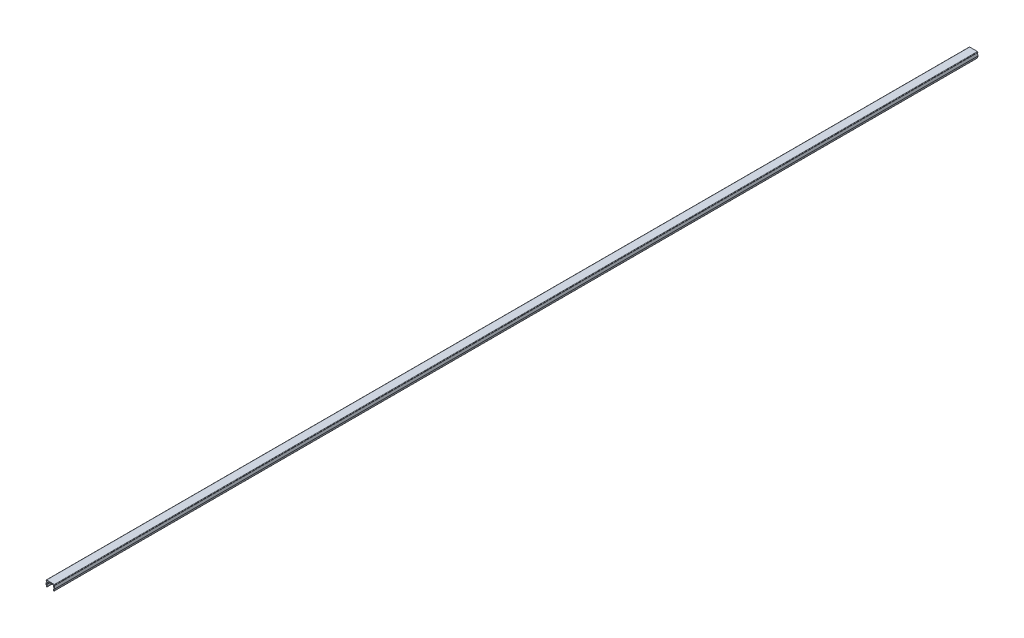
ISO-10303-21;
HEADER;
FILE_DESCRIPTION(('STEP AP214'),'2;1');
FILE_NAME('part.step','',(''),(''),'','','');
FILE_SCHEMA(('AUTOMOTIVE_DESIGN { 1 0 10303 214 1 1 1 1 }'));
ENDSEC;
DATA;
#1=APPLICATION_CONTEXT('core data for automotive mechanical design processes');
#2=APPLICATION_PROTOCOL_DEFINITION('international standard','automotive_design',2000,#1);
#3=PRODUCT_CONTEXT('',#1,'mechanical');
#4=PRODUCT('Part','Part','',(#3));
#5=PRODUCT_RELATED_PRODUCT_CATEGORY('part','',(#4));
#6=PRODUCT_DEFINITION_FORMATION('','',#4);
#7=PRODUCT_DEFINITION_CONTEXT('part definition',#1,'design');
#8=PRODUCT_DEFINITION('design','',#6,#7);
#9=PRODUCT_DEFINITION_SHAPE('','',#8);
#10=(LENGTH_UNIT() NAMED_UNIT(*) SI_UNIT(.MILLI.,.METRE.));
#11=(NAMED_UNIT(*) PLANE_ANGLE_UNIT() SI_UNIT($,.RADIAN.));
#12=(NAMED_UNIT(*) SI_UNIT($,.STERADIAN.) SOLID_ANGLE_UNIT());
#13=UNCERTAINTY_MEASURE_WITH_UNIT(LENGTH_MEASURE(1.E-05),#10,'distance_accuracy_value','');
#14=(GEOMETRIC_REPRESENTATION_CONTEXT(3) GLOBAL_UNCERTAINTY_ASSIGNED_CONTEXT((#13)) GLOBAL_UNIT_ASSIGNED_CONTEXT((#10,
#11,#12)) REPRESENTATION_CONTEXT('',''));
#15=CARTESIAN_POINT('',(0.,0.,0.));
#16=DIRECTION('',(0.,0.,1.));
#17=DIRECTION('',(1.,0.,0.));
#18=AXIS2_PLACEMENT_3D('',#15,#16,#17);
#19=CARTESIAN_POINT('',(-1.50333862518597,5.54999984480356,1000.));
#20=DIRECTION('',(0.,1.,0.));
#21=DIRECTION('',(-1.,0.,0.));
#22=AXIS2_PLACEMENT_3D('',#19,#20,#21);
#23=PLANE('',#22);
#24=DIRECTION('',(1.,0.,0.));
#25=VECTOR('',#24,1.);
#26=CARTESIAN_POINT('',(-1.50333862518597,5.54999984480356,0.));
#27=LINE('',#26,#25);
#28=CARTESIAN_POINT('',(0.463676033435969,5.54999984480356,0.));
#29=VERTEX_POINT('',#28);
#30=CARTESIAN_POINT('',(5.87964671619209,5.54999984480356,0.));
#31=VERTEX_POINT('',#30);
#32=EDGE_CURVE('E203',#29,#31,#27,.T.);
#33=ORIENTED_EDGE('',*,*,#32,.T.);
#34=DIRECTION('',(0.,0.,-1.));
#35=VECTOR('',#34,1.);
#36=CARTESIAN_POINT('',(5.87964671619209,5.54999984480356,1000.));
#37=LINE('',#36,#35);
#38=CARTESIAN_POINT('',(5.87964671619209,5.54999984480356,1000.));
#39=VERTEX_POINT('',#38);
#40=EDGE_CURVE('E245',#31,#39,#37,.F.);
#41=ORIENTED_EDGE('',*,*,#40,.T.);
#42=DIRECTION('',(1.,0.,0.));
#43=VECTOR('',#42,1.);
#44=CARTESIAN_POINT('',(-1.50333862518597,5.54999984480356,1000.));
#45=LINE('',#44,#43);
#46=CARTESIAN_POINT('',(0.463676033435969,5.54999984480356,1000.));
#47=VERTEX_POINT('',#46);
#48=EDGE_CURVE('E232',#47,#39,#45,.T.);
#49=ORIENTED_EDGE('',*,*,#48,.F.);
#50=DIRECTION('',(0.,0.,-1.));
#51=VECTOR('',#50,1.);
#52=CARTESIAN_POINT('',(0.463676033435969,5.54999984480356,1000.));
#53=LINE('',#52,#51);
#54=EDGE_CURVE('E242',#47,#29,#53,.T.);
#55=ORIENTED_EDGE('',*,*,#54,.T.);
#56=EDGE_LOOP('',(#33,#41,#49,#55));
#57=FACE_BOUND('',#56,.T.);
#58=ADVANCED_FACE('F16',(#57),#23,.F.);
#59=CARTESIAN_POINT('',(-1.00333862518597,5.54999984480356,1000.));
#60=VERTEX_POINT('',#59);
#61=CARTESIAN_POINT('',(-0.959640072143999,5.54999984480356,1000.));
#62=VERTEX_POINT('',#61);
#63=EDGE_CURVE('E230',#60,#62,#45,.T.);
#64=ORIENTED_EDGE('',*,*,#63,.F.);
#65=DIRECTION('',(0.,0.,-1.));
#66=VECTOR('',#65,1.);
#67=CARTESIAN_POINT('',(-1.00333862518597,5.54999984480356,0.));
#68=LINE('',#67,#66);
#69=CARTESIAN_POINT('',(-1.00333862518597,5.54999984480356,0.));
#70=VERTEX_POINT('',#69);
#71=EDGE_CURVE('E198',#60,#70,#68,.T.);
#72=ORIENTED_EDGE('',*,*,#71,.T.);
#73=CARTESIAN_POINT('',(-0.959640072143999,5.54999984480356,0.));
#74=VERTEX_POINT('',#73);
#75=EDGE_CURVE('E191',#70,#74,#27,.T.);
#76=ORIENTED_EDGE('',*,*,#75,.T.);
#77=DIRECTION('',(0.,0.,-1.));
#78=VECTOR('',#77,1.);
#79=CARTESIAN_POINT('',(-0.959640072143999,5.54999984480356,1000.));
#80=LINE('',#79,#78);
#81=EDGE_CURVE('E195',#62,#74,#80,.T.);
#82=ORIENTED_EDGE('',*,*,#81,.F.);
#83=EDGE_LOOP('',(#64,#72,#76,#82));
#84=FACE_BOUND('',#83,.T.);
#85=ADVANCED_FACE('F194',(#84),#23,.F.);
#86=CARTESIAN_POINT('',(7.30296282177206,5.54999984480356,0.));
#87=VERTEX_POINT('',#86);
#88=CARTESIAN_POINT('',(7.34666137481403,5.54999984480356,0.));
#89=VERTEX_POINT('',#88);
#90=EDGE_CURVE('E205',#87,#89,#27,.T.);
#91=ORIENTED_EDGE('',*,*,#90,.T.);
#92=DIRECTION('',(0.,0.,-1.));
#93=VECTOR('',#92,1.);
#94=CARTESIAN_POINT('',(7.34666137481403,5.54999984480356,1000.));
#95=LINE('',#94,#93);
#96=CARTESIAN_POINT('',(7.34666137481403,5.54999984480356,1000.));
#97=VERTEX_POINT('',#96);
#98=EDGE_CURVE('E320',#89,#97,#95,.F.);
#99=ORIENTED_EDGE('',*,*,#98,.T.);
#100=CARTESIAN_POINT('',(7.30296282177206,5.54999984480356,1000.));
#101=VERTEX_POINT('',#100);
#102=EDGE_CURVE('E233',#101,#97,#45,.T.);
#103=ORIENTED_EDGE('',*,*,#102,.F.);
#104=DIRECTION('',(0.,0.,-1.));
#105=VECTOR('',#104,1.);
#106=CARTESIAN_POINT('',(7.30296282177206,5.54999984480356,1000.));
#107=LINE('',#106,#105);
#108=EDGE_CURVE('E410',#101,#87,#107,.T.);
#109=ORIENTED_EDGE('',*,*,#108,.T.);
#110=EDGE_LOOP('',(#91,#99,#103,#109));
#111=FACE_BOUND('',#110,.T.);
#112=ADVANCED_FACE('F371',(#111),#23,.F.);
#113=CARTESIAN_POINT('',(-1.50333862518597,6.54999984480356,1000.));
#114=DIRECTION('',(0.,1.,0.));
#115=DIRECTION('',(-1.,0.,0.));
#116=AXIS2_PLACEMENT_3D('',#113,#114,#115);
#117=PLANE('',#116);
#118=DIRECTION('',(1.,0.,0.));
#119=VECTOR('',#118,1.);
#120=CARTESIAN_POINT('',(-1.50333862518597,6.54999984480356,1000.));
#121=LINE('',#120,#119);
#122=CARTESIAN_POINT('',(-1.00333862518597,6.54999984480356,1000.));
#123=VERTEX_POINT('',#122);
#124=CARTESIAN_POINT('',(7.34666137481403,6.54999984480356,1000.));
#125=VERTEX_POINT('',#124);
#126=EDGE_CURVE('E214',#123,#125,#121,.T.);
#127=ORIENTED_EDGE('',*,*,#126,.T.);
#128=DIRECTION('',(0.,0.,-1.));
#129=VECTOR('',#128,1.);
#130=CARTESIAN_POINT('',(7.34666137481403,6.54999984480356,1000.));
#131=LINE('',#130,#129);
#132=CARTESIAN_POINT('',(7.34666137481403,6.54999984480356,0.));
#133=VERTEX_POINT('',#132);
#134=EDGE_CURVE('E317',#125,#133,#131,.T.);
#135=ORIENTED_EDGE('',*,*,#134,.T.);
#136=DIRECTION('',(1.,0.,0.));
#137=VECTOR('',#136,1.);
#138=CARTESIAN_POINT('',(-1.50333862518597,6.54999984480356,0.));
#139=LINE('',#138,#137);
#140=CARTESIAN_POINT('',(-1.00333862518597,6.54999984480356,0.));
#141=VERTEX_POINT('',#140);
#142=EDGE_CURVE('E202',#141,#133,#139,.T.);
#143=ORIENTED_EDGE('',*,*,#142,.F.);
#144=DIRECTION('',(0.,0.,-1.));
#145=VECTOR('',#144,1.);
#146=CARTESIAN_POINT('',(-1.00333862518597,6.54999984480356,1000.));
#147=LINE('',#146,#145);
#148=EDGE_CURVE('E314',#141,#123,#147,.F.);
#149=ORIENTED_EDGE('',*,*,#148,.T.);
#150=EDGE_LOOP('',(#127,#135,#143,#149));
#151=FACE_BOUND('',#150,.T.);
#152=ADVANCED_FACE('F359',(#151),#117,.T.);
#153=CARTESIAN_POINT('',(0.,0.,1000.));
#154=DIRECTION('',(0.,0.,-1.));
#155=DIRECTION('',(-1.,0.,0.));
#156=AXIS2_PLACEMENT_3D('',#153,#154,#155);
#157=PLANE('',#156);
#158=DIRECTION('',(0.230433167257532,-0.973088153985888,0.));
#159=VECTOR('',#158,1.);
#160=CARTESIAN_POINT('',(-1.61488270217891,2.53478326117479,1000.));
#161=LINE('',#160,#159);
#162=CARTESIAN_POINT('',(-1.61488270217891,2.53478326117479,1000.));
#163=VERTEX_POINT('',#162);
#164=CARTESIAN_POINT('',(-1.16176475295702,0.621327338167737,1000.));
#165=VERTEX_POINT('',#164);
#166=EDGE_CURVE('E219',#163,#165,#161,.T.);
#167=ORIENTED_EDGE('',*,*,#166,.T.);
#168=CARTESIAN_POINT('',(-0.67522067596408,0.736543921796503,1000.));
#169=DIRECTION('',(0.,0.,-1.));
#170=DIRECTION('',(-1.,0.,0.));
#171=AXIS2_PLACEMENT_3D('',#168,#169,#170);
#172=CIRCLE('',#171,0.5);
#173=CARTESIAN_POINT('',(-0.560004092335314,0.249999844803559,1000.));
#174=VERTEX_POINT('',#173);
#175=EDGE_CURVE('E294',#165,#174,#172,.F.);
#176=ORIENTED_EDGE('',*,*,#175,.T.);
#177=CARTESIAN_POINT('',(-0.67522067596408,0.736543921796503,1000.));
#178=DIRECTION('',(0.,0.,-1.));
#179=DIRECTION('',(-1.,0.,0.));
#180=AXIS2_PLACEMENT_3D('',#177,#178,#179);
#181=CIRCLE('',#180,0.5);
#182=CARTESIAN_POINT('',(-0.188676598971136,0.851760505425268,1000.));
#183=VERTEX_POINT('',#182);
#184=EDGE_CURVE('E33',#174,#183,#181,.F.);
#185=ORIENTED_EDGE('',*,*,#184,.T.);
#186=DIRECTION('',(0.230433167257532,-0.973088153985888,0.));
#187=VECTOR('',#186,1.);
#188=CARTESIAN_POINT('',(-0.641794548193026,2.76521642843232,1000.));
#189=LINE('',#188,#187);
#190=CARTESIAN_POINT('',(-0.587400808574012,2.53551900985238,1000.));
#191=VERTEX_POINT('',#190);
#192=EDGE_CURVE('E223',#191,#183,#189,.T.);
#193=ORIENTED_EDGE('',*,*,#192,.F.);
#194=CARTESIAN_POINT('',(-0.100856731581068,2.65073559348115,1000.));
#195=DIRECTION('',(0.,0.,-1.));
#196=DIRECTION('',(-1.,0.,0.));
#197=AXIS2_PLACEMENT_3D('',#194,#195,#196);
#198=CIRCLE('',#197,0.5);
#199=CARTESIAN_POINT('',(-0.587565315747856,2.76525526034392,1000.));
#200=VERTEX_POINT('',#199);
#201=EDGE_CURVE('E10',#191,#200,#198,.T.);
#202=ORIENTED_EDGE('',*,*,#201,.T.);
#203=DIRECTION('',(-0.229039333725547,-0.973417168333576,0.));
#204=VECTOR('',#203,1.);
#205=CARTESIAN_POINT('',(0.158369958980817,5.93548017794078,1000.));
#206=LINE('',#205,#204);
#207=CARTESIAN_POINT('',(-0.0230325507308186,5.16451951166633,1000.));
#208=VERTEX_POINT('',#207);
#209=EDGE_CURVE('E414',#208,#200,#206,.T.);
#210=ORIENTED_EDGE('',*,*,#209,.F.);
#211=CARTESIAN_POINT('',(0.463676033435969,5.04999984480356,1000.));
#212=DIRECTION('',(0.,0.,-1.));
#213=DIRECTION('',(-1.,0.,0.));
#214=AXIS2_PLACEMENT_3D('',#211,#212,#213);
#215=CIRCLE('',#214,0.5);
#216=EDGE_CURVE('E329',#208,#47,#215,.T.);
#217=ORIENTED_EDGE('',*,*,#216,.T.);
#218=ORIENTED_EDGE('',*,*,#48,.T.);
#219=CARTESIAN_POINT('',(5.87964671619209,5.04999984480356,1000.));
#220=DIRECTION('',(0.,0.,-1.));
#221=DIRECTION('',(-1.,0.,0.));
#222=AXIS2_PLACEMENT_3D('',#219,#220,#221);
#223=CIRCLE('',#222,0.5);
#224=CARTESIAN_POINT('',(6.36635530035888,5.16451951166633,1000.));
#225=VERTEX_POINT('',#224);
#226=EDGE_CURVE('E325',#39,#225,#223,.T.);
#227=ORIENTED_EDGE('',*,*,#226,.T.);
#228=DIRECTION('',(0.229039333725547,-0.973417168333576,0.));
#229=VECTOR('',#228,1.);
#230=CARTESIAN_POINT('',(6.18495279064724,5.93548017794078,1000.));
#231=LINE('',#230,#229);
#232=CARTESIAN_POINT('',(6.93088806537592,2.76525526034392,1000.));
#233=VERTEX_POINT('',#232);
#234=EDGE_CURVE('E395',#225,#233,#231,.T.);
#235=ORIENTED_EDGE('',*,*,#234,.T.);
#236=CARTESIAN_POINT('',(6.44417948120913,2.65073559348115,1000.));
#237=DIRECTION('',(0.,0.,-1.));
#238=DIRECTION('',(-1.,0.,0.));
#239=AXIS2_PLACEMENT_3D('',#236,#237,#238);
#240=CIRCLE('',#239,0.5);
#241=CARTESIAN_POINT('',(6.93072355820207,2.53551900985238,1000.));
#242=VERTEX_POINT('',#241);
#243=EDGE_CURVE('E333',#233,#242,#240,.T.);
#244=ORIENTED_EDGE('',*,*,#243,.T.);
#245=DIRECTION('',(-0.230433167257532,-0.973088153985888,0.));
#246=VECTOR('',#245,1.);
#247=CARTESIAN_POINT('',(6.98511729782109,2.76521642843233,1000.));
#248=LINE('',#247,#246);
#249=CARTESIAN_POINT('',(6.5319993485992,0.851760505425269,1000.));
#250=VERTEX_POINT('',#249);
#251=EDGE_CURVE('E399',#242,#250,#248,.T.);
#252=ORIENTED_EDGE('',*,*,#251,.T.);
#253=CARTESIAN_POINT('',(7.01854342559214,0.736543921796504,1000.));
#254=DIRECTION('',(0.,0.,-1.));
#255=DIRECTION('',(-1.,0.,0.));
#256=AXIS2_PLACEMENT_3D('',#253,#254,#255);
#257=CIRCLE('',#256,0.5);
#258=CARTESIAN_POINT('',(6.90332684196337,0.24999984480356,1000.));
#259=VERTEX_POINT('',#258);
#260=EDGE_CURVE('E289',#250,#259,#257,.F.);
#261=ORIENTED_EDGE('',*,*,#260,.T.);
#262=CARTESIAN_POINT('',(7.01854342559214,0.736543921796504,1000.));
#263=DIRECTION('',(0.,0.,-1.));
#264=DIRECTION('',(-1.,0.,0.));
#265=AXIS2_PLACEMENT_3D('',#262,#263,#264);
#266=CIRCLE('',#265,0.5);
#267=CARTESIAN_POINT('',(7.50508750258508,0.621327338167738,1000.));
#268=VERTEX_POINT('',#267);
#269=EDGE_CURVE('E291',#259,#268,#266,.F.);
#270=ORIENTED_EDGE('',*,*,#269,.T.);
#271=DIRECTION('',(-0.230433167257532,-0.973088153985888,0.));
#272=VECTOR('',#271,1.);
#273=CARTESIAN_POINT('',(7.95820545180697,2.53478326117479,1000.));
#274=LINE('',#273,#272);
#275=CARTESIAN_POINT('',(7.95820545180697,2.53478326117479,1000.));
#276=VERTEX_POINT('',#275);
#277=EDGE_CURVE('E403',#276,#268,#274,.T.);
#278=ORIENTED_EDGE('',*,*,#277,.F.);
#279=CARTESIAN_POINT('',(7.47166137481403,2.64999984480356,1000.));
#280=DIRECTION('',(0.,0.,-1.));
#281=DIRECTION('',(-1.,0.,0.));
#282=AXIS2_PLACEMENT_3D('',#279,#280,#281);
#283=CIRCLE('',#282,0.5);
#284=CARTESIAN_POINT('',(7.95836995898082,2.76451951166633,1000.));
#285=VERTEX_POINT('',#284);
#286=EDGE_CURVE('E285',#276,#285,#283,.F.);
#287=ORIENTED_EDGE('',*,*,#286,.T.);
#288=DIRECTION('',(0.229039333725547,-0.973417168333576,0.));
#289=VECTOR('',#288,1.);
#290=CARTESIAN_POINT('',(7.15836995898082,6.16451951166633,1000.));
#291=LINE('',#290,#289);
#292=EDGE_CURVE('E375',#101,#285,#291,.T.);
#293=ORIENTED_EDGE('',*,*,#292,.F.);
#294=ORIENTED_EDGE('',*,*,#102,.T.);
#295=CARTESIAN_POINT('',(7.34666137481403,6.04999984480356,1000.));
#296=DIRECTION('',(0.,0.,-1.));
#297=DIRECTION('',(-1.,0.,0.));
#298=AXIS2_PLACEMENT_3D('',#295,#296,#297);
#299=CIRCLE('',#298,0.5);
#300=CARTESIAN_POINT('',(7.84666137481403,6.04999984480356,1000.));
#301=VERTEX_POINT('',#300);
#302=EDGE_CURVE('E281',#97,#301,#299,.F.);
#303=ORIENTED_EDGE('',*,*,#302,.T.);
#304=CARTESIAN_POINT('',(7.34666137481403,6.04999984480356,1000.));
#305=DIRECTION('',(0.,0.,-1.));
#306=DIRECTION('',(-1.,0.,0.));
#307=AXIS2_PLACEMENT_3D('',#304,#305,#306);
#308=CIRCLE('',#307,0.5);
#309=EDGE_CURVE('E283',#301,#125,#308,.F.);
#310=ORIENTED_EDGE('',*,*,#309,.T.);
#311=ORIENTED_EDGE('',*,*,#126,.F.);
#312=CARTESIAN_POINT('',(-1.00333862518597,6.04999984480356,1000.));
#313=DIRECTION('',(0.,0.,-1.));
#314=DIRECTION('',(-1.,0.,0.));
#315=AXIS2_PLACEMENT_3D('',#312,#313,#314);
#316=CIRCLE('',#315,0.5);
#317=CARTESIAN_POINT('',(-1.50333862518597,6.04999984480356,1000.));
#318=VERTEX_POINT('',#317);
#319=EDGE_CURVE('E279',#123,#318,#316,.F.);
#320=ORIENTED_EDGE('',*,*,#319,.T.);
#321=CARTESIAN_POINT('',(-1.00333862518597,6.04999984480356,1000.));
#322=DIRECTION('',(0.,0.,-1.));
#323=DIRECTION('',(-1.,0.,0.));
#324=AXIS2_PLACEMENT_3D('',#321,#322,#323);
#325=CIRCLE('',#324,0.5);
#326=EDGE_CURVE('E277',#318,#60,#325,.F.);
#327=ORIENTED_EDGE('',*,*,#326,.T.);
#328=ORIENTED_EDGE('',*,*,#63,.T.);
#329=DIRECTION('',(-0.229039333725547,-0.973417168333576,0.));
#330=VECTOR('',#329,1.);
#331=CARTESIAN_POINT('',(-0.815047209352759,6.16451951166633,1000.));
#332=LINE('',#331,#330);
#333=CARTESIAN_POINT('',(-1.61504720935276,2.76451951166633,1000.));
#334=VERTEX_POINT('',#333);
#335=EDGE_CURVE('E212',#62,#334,#332,.T.);
#336=ORIENTED_EDGE('',*,*,#335,.T.);
#337=CARTESIAN_POINT('',(-1.12833862518597,2.64999984480356,1000.));
#338=DIRECTION('',(0.,0.,-1.));
#339=DIRECTION('',(-1.,0.,0.));
#340=AXIS2_PLACEMENT_3D('',#337,#338,#339);
#341=CIRCLE('',#340,0.5);
#342=EDGE_CURVE('E287',#334,#163,#341,.F.);
#343=ORIENTED_EDGE('',*,*,#342,.T.);
#344=EDGE_LOOP('',(#167,#176,#185,#193,#202,#210,#217,#218,#227,#235,#244,#252,#261,#270,#278,
#287,#293,#294,#303,#310,#311,#320,#327,#328,#336,#343));
#345=FACE_BOUND('',#344,.T.);
#346=ADVANCED_FACE('F355',(#345),#157,.F.);
#347=CARTESIAN_POINT('',(0.,0.,0.));
#348=DIRECTION('',(0.,0.,-1.));
#349=DIRECTION('',(-1.,0.,0.));
#350=AXIS2_PLACEMENT_3D('',#347,#348,#349);
#351=PLANE('',#350);
#352=CARTESIAN_POINT('',(-0.67522067596408,0.736543921796503,0.));
#353=DIRECTION('',(0.,0.,-1.));
#354=DIRECTION('',(-1.,0.,0.));
#355=AXIS2_PLACEMENT_3D('',#352,#353,#354);
#356=CIRCLE('',#355,0.5);
#357=CARTESIAN_POINT('',(-0.188676598971136,0.851760505425268,0.));
#358=VERTEX_POINT('',#357);
#359=CARTESIAN_POINT('',(-0.560004092335314,0.249999844803559,0.));
#360=VERTEX_POINT('',#359);
#361=EDGE_CURVE('E267',#358,#360,#356,.T.);
#362=ORIENTED_EDGE('',*,*,#361,.T.);
#363=CARTESIAN_POINT('',(-0.67522067596408,0.736543921796503,0.));
#364=DIRECTION('',(0.,0.,-1.));
#365=DIRECTION('',(-1.,0.,0.));
#366=AXIS2_PLACEMENT_3D('',#363,#364,#365);
#367=CIRCLE('',#366,0.5);
#368=CARTESIAN_POINT('',(-1.16176475295702,0.621327338167737,0.));
#369=VERTEX_POINT('',#368);
#370=EDGE_CURVE('E269',#360,#369,#367,.T.);
#371=ORIENTED_EDGE('',*,*,#370,.T.);
#372=DIRECTION('',(0.230433167257532,-0.973088153985888,0.));
#373=VECTOR('',#372,1.);
#374=CARTESIAN_POINT('',(-1.61488270217891,2.53478326117479,0.));
#375=LINE('',#374,#373);
#376=CARTESIAN_POINT('',(-1.61488270217891,2.53478326117479,0.));
#377=VERTEX_POINT('',#376);
#378=EDGE_CURVE('E411',#377,#369,#375,.T.);
#379=ORIENTED_EDGE('',*,*,#378,.F.);
#380=CARTESIAN_POINT('',(-1.12833862518597,2.64999984480356,0.));
#381=DIRECTION('',(0.,0.,-1.));
#382=DIRECTION('',(-1.,0.,0.));
#383=AXIS2_PLACEMENT_3D('',#380,#381,#382);
#384=CIRCLE('',#383,0.5);
#385=CARTESIAN_POINT('',(-1.61504720935276,2.76451951166633,0.));
#386=VERTEX_POINT('',#385);
#387=EDGE_CURVE('E218',#377,#386,#384,.T.);
#388=ORIENTED_EDGE('',*,*,#387,.T.);
#389=DIRECTION('',(-0.229039333725547,-0.973417168333576,0.));
#390=VECTOR('',#389,1.);
#391=CARTESIAN_POINT('',(-0.815047209352759,6.16451951166633,0.));
#392=LINE('',#391,#390);
#393=EDGE_CURVE('E209',#74,#386,#392,.T.);
#394=ORIENTED_EDGE('',*,*,#393,.F.);
#395=ORIENTED_EDGE('',*,*,#75,.F.);
#396=CARTESIAN_POINT('',(-1.00333862518597,6.04999984480356,0.));
#397=DIRECTION('',(0.,0.,-1.));
#398=DIRECTION('',(-1.,0.,0.));
#399=AXIS2_PLACEMENT_3D('',#396,#397,#398);
#400=CIRCLE('',#399,0.5);
#401=CARTESIAN_POINT('',(-1.50333862518597,6.04999984480356,0.));
#402=VERTEX_POINT('',#401);
#403=EDGE_CURVE('E252',#70,#402,#400,.T.);
#404=ORIENTED_EDGE('',*,*,#403,.T.);
#405=CARTESIAN_POINT('',(-1.00333862518597,6.04999984480356,0.));
#406=DIRECTION('',(0.,0.,-1.));
#407=DIRECTION('',(-1.,0.,0.));
#408=AXIS2_PLACEMENT_3D('',#405,#406,#407);
#409=CIRCLE('',#408,0.5);
#410=EDGE_CURVE('E254',#402,#141,#409,.T.);
#411=ORIENTED_EDGE('',*,*,#410,.T.);
#412=ORIENTED_EDGE('',*,*,#142,.T.);
#413=CARTESIAN_POINT('',(7.34666137481403,6.04999984480356,0.));
#414=DIRECTION('',(0.,0.,-1.));
#415=DIRECTION('',(-1.,0.,0.));
#416=AXIS2_PLACEMENT_3D('',#413,#414,#415);
#417=CIRCLE('',#416,0.5);
#418=CARTESIAN_POINT('',(7.84666137481403,6.04999984480356,0.));
#419=VERTEX_POINT('',#418);
#420=EDGE_CURVE('E258',#133,#419,#417,.T.);
#421=ORIENTED_EDGE('',*,*,#420,.T.);
#422=CARTESIAN_POINT('',(7.34666137481403,6.04999984480356,0.));
#423=DIRECTION('',(0.,0.,-1.));
#424=DIRECTION('',(-1.,0.,0.));
#425=AXIS2_PLACEMENT_3D('',#422,#423,#424);
#426=CIRCLE('',#425,0.5);
#427=EDGE_CURVE('E256',#419,#89,#426,.T.);
#428=ORIENTED_EDGE('',*,*,#427,.T.);
#429=ORIENTED_EDGE('',*,*,#90,.F.);
#430=DIRECTION('',(0.229039333725547,-0.973417168333576,0.));
#431=VECTOR('',#430,1.);
#432=CARTESIAN_POINT('',(7.15836995898082,6.16451951166633,0.));
#433=LINE('',#432,#431);
#434=CARTESIAN_POINT('',(7.95836995898082,2.76451951166633,0.));
#435=VERTEX_POINT('',#434);
#436=EDGE_CURVE('E400',#87,#435,#433,.T.);
#437=ORIENTED_EDGE('',*,*,#436,.T.);
#438=CARTESIAN_POINT('',(7.47166137481403,2.64999984480356,0.));
#439=DIRECTION('',(0.,0.,-1.));
#440=DIRECTION('',(-1.,0.,0.));
#441=AXIS2_PLACEMENT_3D('',#438,#439,#440);
#442=CIRCLE('',#441,0.5);
#443=CARTESIAN_POINT('',(7.95820545180697,2.53478326117479,0.));
#444=VERTEX_POINT('',#443);
#445=EDGE_CURVE('E260',#435,#444,#442,.T.);
#446=ORIENTED_EDGE('',*,*,#445,.T.);
#447=DIRECTION('',(-0.230433167257532,-0.973088153985888,0.));
#448=VECTOR('',#447,1.);
#449=CARTESIAN_POINT('',(7.95820545180697,2.53478326117479,0.));
#450=LINE('',#449,#448);
#451=CARTESIAN_POINT('',(7.50508750258508,0.621327338167738,0.));
#452=VERTEX_POINT('',#451);
#453=EDGE_CURVE('E406',#444,#452,#450,.T.);
#454=ORIENTED_EDGE('',*,*,#453,.T.);
#455=CARTESIAN_POINT('',(7.01854342559214,0.736543921796504,0.));
#456=DIRECTION('',(0.,0.,-1.));
#457=DIRECTION('',(-1.,0.,0.));
#458=AXIS2_PLACEMENT_3D('',#455,#456,#457);
#459=CIRCLE('',#458,0.5);
#460=CARTESIAN_POINT('',(6.90332684196337,0.24999984480356,0.));
#461=VERTEX_POINT('',#460);
#462=EDGE_CURVE('E265',#452,#461,#459,.T.);
#463=ORIENTED_EDGE('',*,*,#462,.T.);
#464=CARTESIAN_POINT('',(7.01854342559214,0.736543921796504,0.));
#465=DIRECTION('',(0.,0.,-1.));
#466=DIRECTION('',(-1.,0.,0.));
#467=AXIS2_PLACEMENT_3D('',#464,#465,#466);
#468=CIRCLE('',#467,0.5);
#469=CARTESIAN_POINT('',(6.5319993485992,0.851760505425269,0.));
#470=VERTEX_POINT('',#469);
#471=EDGE_CURVE('E263',#461,#470,#468,.T.);
#472=ORIENTED_EDGE('',*,*,#471,.T.);
#473=DIRECTION('',(-0.230433167257532,-0.973088153985888,0.));
#474=VECTOR('',#473,1.);
#475=CARTESIAN_POINT('',(6.98511729782109,2.76521642843233,0.));
#476=LINE('',#475,#474);
#477=CARTESIAN_POINT('',(6.93072355820207,2.53551900985238,0.));
#478=VERTEX_POINT('',#477);
#479=EDGE_CURVE('E339',#478,#470,#476,.T.);
#480=ORIENTED_EDGE('',*,*,#479,.F.);
#481=CARTESIAN_POINT('',(6.44417948120913,2.65073559348115,0.));
#482=DIRECTION('',(0.,0.,-1.));
#483=DIRECTION('',(-1.,0.,0.));
#484=AXIS2_PLACEMENT_3D('',#481,#482,#483);
#485=CIRCLE('',#484,0.5);
#486=CARTESIAN_POINT('',(6.93088806537592,2.76525526034392,0.));
#487=VERTEX_POINT('',#486);
#488=EDGE_CURVE('E331',#478,#487,#485,.F.);
#489=ORIENTED_EDGE('',*,*,#488,.T.);
#490=DIRECTION('',(0.229039333725547,-0.973417168333576,0.));
#491=VECTOR('',#490,1.);
#492=CARTESIAN_POINT('',(6.18495279064724,5.93548017794078,0.));
#493=LINE('',#492,#491);
#494=CARTESIAN_POINT('',(6.36635530035888,5.16451951166633,0.));
#495=VERTEX_POINT('',#494);
#496=EDGE_CURVE('E393',#495,#487,#493,.T.);
#497=ORIENTED_EDGE('',*,*,#496,.F.);
#498=CARTESIAN_POINT('',(5.87964671619209,5.04999984480356,0.));
#499=DIRECTION('',(0.,0.,-1.));
#500=DIRECTION('',(-1.,0.,0.));
#501=AXIS2_PLACEMENT_3D('',#498,#499,#500);
#502=CIRCLE('',#501,0.5);
#503=EDGE_CURVE('E323',#495,#31,#502,.F.);
#504=ORIENTED_EDGE('',*,*,#503,.T.);
#505=ORIENTED_EDGE('',*,*,#32,.F.);
#506=CARTESIAN_POINT('',(0.463676033435969,5.04999984480356,0.));
#507=DIRECTION('',(0.,0.,-1.));
#508=DIRECTION('',(-1.,0.,0.));
#509=AXIS2_PLACEMENT_3D('',#506,#507,#508);
#510=CIRCLE('',#509,0.5);
#511=CARTESIAN_POINT('',(-0.0230325507308186,5.16451951166633,0.));
#512=VERTEX_POINT('',#511);
#513=EDGE_CURVE('E327',#29,#512,#510,.F.);
#514=ORIENTED_EDGE('',*,*,#513,.T.);
#515=DIRECTION('',(-0.229039333725547,-0.973417168333576,0.));
#516=VECTOR('',#515,1.);
#517=CARTESIAN_POINT('',(0.158369958980817,5.93548017794078,0.));
#518=LINE('',#517,#516);
#519=CARTESIAN_POINT('',(-0.587565315747856,2.76525526034392,0.));
#520=VERTEX_POINT('',#519);
#521=EDGE_CURVE('E220',#512,#520,#518,.T.);
#522=ORIENTED_EDGE('',*,*,#521,.T.);
#523=CARTESIAN_POINT('',(-0.100856731581068,2.65073559348115,0.));
#524=DIRECTION('',(0.,0.,-1.));
#525=DIRECTION('',(-1.,0.,0.));
#526=AXIS2_PLACEMENT_3D('',#523,#524,#525);
#527=CIRCLE('',#526,0.5);
#528=CARTESIAN_POINT('',(-0.587400808574012,2.53551900985238,0.));
#529=VERTEX_POINT('',#528);
#530=EDGE_CURVE('E25',#520,#529,#527,.F.);
#531=ORIENTED_EDGE('',*,*,#530,.T.);
#532=DIRECTION('',(0.230433167257532,-0.973088153985888,0.));
#533=VECTOR('',#532,1.);
#534=CARTESIAN_POINT('',(-0.641794548193026,2.76521642843232,0.));
#535=LINE('',#534,#533);
#536=EDGE_CURVE('E226',#529,#358,#535,.T.);
#537=ORIENTED_EDGE('',*,*,#536,.T.);
#538=EDGE_LOOP('',(#362,#371,#379,#388,#394,#395,#404,#411,#412,#421,#428,#429,#437,#446,#454,
#463,#472,#480,#489,#497,#504,#505,#514,#522,#531,#537));
#539=FACE_BOUND('',#538,.T.);
#540=ADVANCED_FACE('F216',(#539),#351,.T.);
#541=CARTESIAN_POINT('',(0.158369958980817,5.93548017794078,1000.));
#542=DIRECTION('',(0.973417168333576,-0.229039333725547,0.));
#543=DIRECTION('',(0.229039333725547,0.973417168333576,0.));
#544=AXIS2_PLACEMENT_3D('',#541,#542,#543);
#545=PLANE('',#544);
#546=ORIENTED_EDGE('',*,*,#521,.F.);
#547=DIRECTION('',(0.,0.,-1.));
#548=VECTOR('',#547,1.);
#549=CARTESIAN_POINT('',(-0.0230325507308185,5.16451951166633,1000.));
#550=LINE('',#549,#548);
#551=EDGE_CURVE('E250',#512,#208,#550,.F.);
#552=ORIENTED_EDGE('',*,*,#551,.T.);
#553=ORIENTED_EDGE('',*,*,#209,.T.);
#554=DIRECTION('',(0.,0.,-1.));
#555=VECTOR('',#554,1.);
#556=CARTESIAN_POINT('',(-0.587565315747856,2.76525526034392,0.));
#557=LINE('',#556,#555);
#558=EDGE_CURVE('E247',#200,#520,#557,.T.);
#559=ORIENTED_EDGE('',*,*,#558,.T.);
#560=EDGE_LOOP('',(#546,#552,#553,#559));
#561=FACE_BOUND('',#560,.T.);
#562=ADVANCED_FACE('F467',(#561),#545,.T.);
#563=CARTESIAN_POINT('',(-0.815047209352759,6.16451951166633,1000.));
#564=DIRECTION('',(0.973417168333576,-0.229039333725547,0.));
#565=DIRECTION('',(0.229039333725547,0.973417168333576,0.));
#566=AXIS2_PLACEMENT_3D('',#563,#564,#565);
#567=PLANE('',#566);
#568=ORIENTED_EDGE('',*,*,#393,.T.);
#569=DIRECTION('',(0.,0.,-1.));
#570=VECTOR('',#569,1.);
#571=CARTESIAN_POINT('',(-1.61504720935276,2.76451951166633,1000.));
#572=LINE('',#571,#570);
#573=EDGE_CURVE('E309',#386,#334,#572,.F.);
#574=ORIENTED_EDGE('',*,*,#573,.T.);
#575=ORIENTED_EDGE('',*,*,#335,.F.);
#576=ORIENTED_EDGE('',*,*,#81,.T.);
#577=EDGE_LOOP('',(#568,#574,#575,#576));
#578=FACE_BOUND('',#577,.T.);
#579=ADVANCED_FACE('F208',(#578),#567,.F.);
#580=CARTESIAN_POINT('',(-1.61488270217891,2.53478326117479,1000.));
#581=DIRECTION('',(0.973088153985888,0.230433167257532,0.));
#582=DIRECTION('',(-0.230433167257532,0.973088153985888,0.));
#583=AXIS2_PLACEMENT_3D('',#580,#581,#582);
#584=PLANE('',#583);
#585=ORIENTED_EDGE('',*,*,#378,.T.);
#586=DIRECTION('',(0.,0.,-1.));
#587=VECTOR('',#586,1.);
#588=CARTESIAN_POINT('',(-1.16176475295702,0.621327338167737,1000.));
#589=LINE('',#588,#587);
#590=EDGE_CURVE('E274',#369,#165,#589,.F.);
#591=ORIENTED_EDGE('',*,*,#590,.T.);
#592=ORIENTED_EDGE('',*,*,#166,.F.);
#593=DIRECTION('',(0.,0.,-1.));
#594=VECTOR('',#593,1.);
#595=CARTESIAN_POINT('',(-1.61488270217891,2.53478326117479,1000.));
#596=LINE('',#595,#594);
#597=EDGE_CURVE('E271',#163,#377,#596,.T.);
#598=ORIENTED_EDGE('',*,*,#597,.T.);
#599=EDGE_LOOP('',(#585,#591,#592,#598));
#600=FACE_BOUND('',#599,.T.);
#601=ADVANCED_FACE('F430',(#600),#584,.F.);
#602=CARTESIAN_POINT('',(-0.641794548193026,2.76521642843232,1000.));
#603=DIRECTION('',(0.973088153985888,0.230433167257532,0.));
#604=DIRECTION('',(-0.230433167257532,0.973088153985888,0.));
#605=AXIS2_PLACEMENT_3D('',#602,#603,#604);
#606=PLANE('',#605);
#607=ORIENTED_EDGE('',*,*,#192,.T.);
#608=DIRECTION('',(0.,0.,-1.));
#609=VECTOR('',#608,1.);
#610=CARTESIAN_POINT('',(-0.188676598971136,0.851760505425268,1000.));
#611=LINE('',#610,#609);
#612=EDGE_CURVE('E297',#183,#358,#611,.T.);
#613=ORIENTED_EDGE('',*,*,#612,.T.);
#614=ORIENTED_EDGE('',*,*,#536,.F.);
#615=DIRECTION('',(0.,0.,-1.));
#616=VECTOR('',#615,1.);
#617=CARTESIAN_POINT('',(-0.587400808574012,2.53551900985238,1000.));
#618=LINE('',#617,#616);
#619=EDGE_CURVE('E40',#529,#191,#618,.F.);
#620=ORIENTED_EDGE('',*,*,#619,.T.);
#621=EDGE_LOOP('',(#607,#613,#614,#620));
#622=FACE_BOUND('',#621,.T.);
#623=ADVANCED_FACE('F471',(#622),#606,.T.);
#624=CARTESIAN_POINT('',(7.15836995898082,6.16451951166633,1000.));
#625=DIRECTION('',(0.973417168333576,0.229039333725547,0.));
#626=DIRECTION('',(-0.229039333725547,0.973417168333576,0.));
#627=AXIS2_PLACEMENT_3D('',#624,#625,#626);
#628=PLANE('',#627);
#629=ORIENTED_EDGE('',*,*,#292,.T.);
#630=DIRECTION('',(0.,0.,-1.));
#631=VECTOR('',#630,1.);
#632=CARTESIAN_POINT('',(7.95836995898082,2.76451951166633,1000.));
#633=LINE('',#632,#631);
#634=EDGE_CURVE('E311',#285,#435,#633,.T.);
#635=ORIENTED_EDGE('',*,*,#634,.T.);
#636=ORIENTED_EDGE('',*,*,#436,.F.);
#637=ORIENTED_EDGE('',*,*,#108,.F.);
#638=EDGE_LOOP('',(#629,#635,#636,#637));
#639=FACE_BOUND('',#638,.T.);
#640=ADVANCED_FACE('F474',(#639),#628,.T.);
#641=CARTESIAN_POINT('',(6.18495279064724,5.93548017794078,1000.));
#642=DIRECTION('',(0.973417168333576,0.229039333725547,0.));
#643=DIRECTION('',(-0.229039333725547,0.973417168333576,0.));
#644=AXIS2_PLACEMENT_3D('',#641,#642,#643);
#645=PLANE('',#644);
#646=ORIENTED_EDGE('',*,*,#234,.F.);
#647=DIRECTION('',(0.,0.,-1.));
#648=VECTOR('',#647,1.);
#649=CARTESIAN_POINT('',(6.36635530035888,5.16451951166633,0.));
#650=LINE('',#649,#648);
#651=EDGE_CURVE('E239',#225,#495,#650,.T.);
#652=ORIENTED_EDGE('',*,*,#651,.T.);
#653=ORIENTED_EDGE('',*,*,#496,.T.);
#654=DIRECTION('',(0.,0.,-1.));
#655=VECTOR('',#654,1.);
#656=CARTESIAN_POINT('',(6.93088806537592,2.76525526034392,1000.));
#657=LINE('',#656,#655);
#658=EDGE_CURVE('E213',#487,#233,#657,.F.);
#659=ORIENTED_EDGE('',*,*,#658,.T.);
#660=EDGE_LOOP('',(#646,#652,#653,#659));
#661=FACE_BOUND('',#660,.T.);
#662=ADVANCED_FACE('F392',(#661),#645,.F.);
#663=CARTESIAN_POINT('',(6.98511729782109,2.76521642843233,1000.));
#664=DIRECTION('',(0.973088153985888,-0.230433167257532,0.));
#665=DIRECTION('',(0.230433167257532,0.973088153985888,0.));
#666=AXIS2_PLACEMENT_3D('',#663,#664,#665);
#667=PLANE('',#666);
#668=ORIENTED_EDGE('',*,*,#479,.T.);
#669=DIRECTION('',(0.,0.,-1.));
#670=VECTOR('',#669,1.);
#671=CARTESIAN_POINT('',(6.5319993485992,0.851760505425269,1000.));
#672=LINE('',#671,#670);
#673=EDGE_CURVE('E307',#470,#250,#672,.F.);
#674=ORIENTED_EDGE('',*,*,#673,.T.);
#675=ORIENTED_EDGE('',*,*,#251,.F.);
#676=DIRECTION('',(0.,0.,-1.));
#677=VECTOR('',#676,1.);
#678=CARTESIAN_POINT('',(6.93072355820207,2.53551900985238,0.));
#679=LINE('',#678,#677);
#680=EDGE_CURVE('E304',#242,#478,#679,.T.);
#681=ORIENTED_EDGE('',*,*,#680,.T.);
#682=EDGE_LOOP('',(#668,#674,#675,#681));
#683=FACE_BOUND('',#682,.T.);
#684=ADVANCED_FACE('F480',(#683),#667,.F.);
#685=CARTESIAN_POINT('',(7.95820545180697,2.53478326117479,1000.));
#686=DIRECTION('',(0.973088153985888,-0.230433167257532,0.));
#687=DIRECTION('',(0.230433167257532,0.973088153985888,0.));
#688=AXIS2_PLACEMENT_3D('',#685,#686,#687);
#689=PLANE('',#688);
#690=ORIENTED_EDGE('',*,*,#277,.T.);
#691=DIRECTION('',(0.,0.,-1.));
#692=VECTOR('',#691,1.);
#693=CARTESIAN_POINT('',(7.50508750258508,0.621327338167738,1000.));
#694=LINE('',#693,#692);
#695=EDGE_CURVE('E301',#268,#452,#694,.T.);
#696=ORIENTED_EDGE('',*,*,#695,.T.);
#697=ORIENTED_EDGE('',*,*,#453,.F.);
#698=DIRECTION('',(0.,0.,-1.));
#699=VECTOR('',#698,1.);
#700=CARTESIAN_POINT('',(7.95820545180697,2.53478326117479,1000.));
#701=LINE('',#700,#699);
#702=EDGE_CURVE('E299',#444,#276,#701,.F.);
#703=ORIENTED_EDGE('',*,*,#702,.T.);
#704=EDGE_LOOP('',(#690,#696,#697,#703));
#705=FACE_BOUND('',#704,.T.);
#706=ADVANCED_FACE('F483',(#705),#689,.T.);
#707=CARTESIAN_POINT('',(5.87964671619209,5.04999984480356,1000.));
#708=DIRECTION('',(0.,0.,1.));
#709=DIRECTION('',(1.,0.,0.));
#710=AXIS2_PLACEMENT_3D('',#707,#708,#709);
#711=CYLINDRICAL_SURFACE('',#710,0.5);
#712=ORIENTED_EDGE('',*,*,#226,.F.);
#713=ORIENTED_EDGE('',*,*,#40,.F.);
#714=ORIENTED_EDGE('',*,*,#503,.F.);
#715=ORIENTED_EDGE('',*,*,#651,.F.);
#716=EDGE_LOOP('',(#712,#713,#714,#715));
#717=FACE_BOUND('',#716,.T.);
#718=ADVANCED_FACE('F388',(#717),#711,.F.);
#719=CARTESIAN_POINT('',(0.463676033435969,5.04999984480356,1000.));
#720=DIRECTION('',(0.,0.,-1.));
#721=DIRECTION('',(-1.,0.,0.));
#722=AXIS2_PLACEMENT_3D('',#719,#720,#721);
#723=CYLINDRICAL_SURFACE('',#722,0.5);
#724=ORIENTED_EDGE('',*,*,#216,.F.);
#725=ORIENTED_EDGE('',*,*,#551,.F.);
#726=ORIENTED_EDGE('',*,*,#513,.F.);
#727=ORIENTED_EDGE('',*,*,#54,.F.);
#728=EDGE_LOOP('',(#724,#725,#726,#727));
#729=FACE_BOUND('',#728,.T.);
#730=ADVANCED_FACE('F515',(#729),#723,.F.);
#731=CARTESIAN_POINT('',(-0.67522067596408,0.736543921796503,1000.));
#732=DIRECTION('',(0.,0.,-1.));
#733=DIRECTION('',(-1.,0.,0.));
#734=AXIS2_PLACEMENT_3D('',#731,#732,#733);
#735=CYLINDRICAL_SURFACE('',#734,0.5);
#736=ORIENTED_EDGE('',*,*,#612,.F.);
#737=ORIENTED_EDGE('',*,*,#184,.F.);
#738=DIRECTION('',(0.,0.,-1.));
#739=VECTOR('',#738,1.);
#740=CARTESIAN_POINT('',(-0.560004092335314,0.249999844803559,1000.));
#741=LINE('',#740,#739);
#742=EDGE_CURVE('E336',#360,#174,#741,.F.);
#743=ORIENTED_EDGE('',*,*,#742,.F.);
#744=ORIENTED_EDGE('',*,*,#361,.F.);
#745=EDGE_LOOP('',(#736,#737,#743,#744));
#746=FACE_BOUND('',#745,.T.);
#747=ADVANCED_FACE('F424',(#746),#735,.T.);
#748=CARTESIAN_POINT('',(-0.67522067596408,0.736543921796503,1000.));
#749=DIRECTION('',(0.,0.,1.));
#750=DIRECTION('',(1.,0.,0.));
#751=AXIS2_PLACEMENT_3D('',#748,#749,#750);
#752=CYLINDRICAL_SURFACE('',#751,0.5);
#753=ORIENTED_EDGE('',*,*,#175,.F.);
#754=ORIENTED_EDGE('',*,*,#590,.F.);
#755=ORIENTED_EDGE('',*,*,#370,.F.);
#756=ORIENTED_EDGE('',*,*,#742,.T.);
#757=EDGE_LOOP('',(#753,#754,#755,#756));
#758=FACE_BOUND('',#757,.T.);
#759=ADVANCED_FACE('F428',(#758),#752,.T.);
#760=CARTESIAN_POINT('',(7.01854342559214,0.736543921796504,1000.));
#761=DIRECTION('',(0.,0.,1.));
#762=DIRECTION('',(1.,0.,0.));
#763=AXIS2_PLACEMENT_3D('',#760,#761,#762);
#764=CYLINDRICAL_SURFACE('',#763,0.5);
#765=DIRECTION('',(0.,0.,-1.));
#766=VECTOR('',#765,1.);
#767=CARTESIAN_POINT('',(6.90332684196337,0.249999844803559,0.));
#768=LINE('',#767,#766);
#769=EDGE_CURVE('E340',#259,#461,#768,.T.);
#770=ORIENTED_EDGE('',*,*,#769,.F.);
#771=ORIENTED_EDGE('',*,*,#260,.F.);
#772=ORIENTED_EDGE('',*,*,#673,.F.);
#773=ORIENTED_EDGE('',*,*,#471,.F.);
#774=EDGE_LOOP('',(#770,#771,#772,#773));
#775=FACE_BOUND('',#774,.T.);
#776=ADVANCED_FACE('F537',(#775),#764,.T.);
#777=CARTESIAN_POINT('',(7.01854342559214,0.736543921796504,1000.));
#778=DIRECTION('',(0.,0.,-1.));
#779=DIRECTION('',(-1.,0.,0.));
#780=AXIS2_PLACEMENT_3D('',#777,#778,#779);
#781=CYLINDRICAL_SURFACE('',#780,0.5);
#782=ORIENTED_EDGE('',*,*,#269,.F.);
#783=ORIENTED_EDGE('',*,*,#769,.T.);
#784=ORIENTED_EDGE('',*,*,#462,.F.);
#785=ORIENTED_EDGE('',*,*,#695,.F.);
#786=EDGE_LOOP('',(#782,#783,#784,#785));
#787=FACE_BOUND('',#786,.T.);
#788=ADVANCED_FACE('F545',(#787),#781,.T.);
#789=CARTESIAN_POINT('',(6.44417948120913,2.65073559348115,1000.));
#790=DIRECTION('',(0.,0.,1.));
#791=DIRECTION('',(1.,0.,0.));
#792=AXIS2_PLACEMENT_3D('',#789,#790,#791);
#793=CYLINDRICAL_SURFACE('',#792,0.5);
#794=ORIENTED_EDGE('',*,*,#243,.F.);
#795=ORIENTED_EDGE('',*,*,#658,.F.);
#796=ORIENTED_EDGE('',*,*,#488,.F.);
#797=ORIENTED_EDGE('',*,*,#680,.F.);
#798=EDGE_LOOP('',(#794,#795,#796,#797));
#799=FACE_BOUND('',#798,.T.);
#800=ADVANCED_FACE('F447',(#799),#793,.F.);
#801=CARTESIAN_POINT('',(-0.100856731581068,2.65073559348115,1000.));
#802=DIRECTION('',(0.,0.,1.));
#803=DIRECTION('',(1.,0.,0.));
#804=AXIS2_PLACEMENT_3D('',#801,#802,#803);
#805=CYLINDRICAL_SURFACE('',#804,0.5);
#806=ORIENTED_EDGE('',*,*,#201,.F.);
#807=ORIENTED_EDGE('',*,*,#619,.F.);
#808=ORIENTED_EDGE('',*,*,#530,.F.);
#809=ORIENTED_EDGE('',*,*,#558,.F.);
#810=EDGE_LOOP('',(#806,#807,#808,#809));
#811=FACE_BOUND('',#810,.T.);
#812=ADVANCED_FACE('F438',(#811),#805,.F.);
#813=CARTESIAN_POINT('',(-1.12833862518597,2.64999984480356,1000.));
#814=DIRECTION('',(0.,0.,-1.));
#815=DIRECTION('',(-1.,0.,0.));
#816=AXIS2_PLACEMENT_3D('',#813,#814,#815);
#817=CYLINDRICAL_SURFACE('',#816,0.5);
#818=ORIENTED_EDGE('',*,*,#342,.F.);
#819=ORIENTED_EDGE('',*,*,#573,.F.);
#820=ORIENTED_EDGE('',*,*,#387,.F.);
#821=ORIENTED_EDGE('',*,*,#597,.F.);
#822=EDGE_LOOP('',(#818,#819,#820,#821));
#823=FACE_BOUND('',#822,.T.);
#824=ADVANCED_FACE('F435',(#823),#817,.T.);
#825=CARTESIAN_POINT('',(7.47166137481403,2.64999984480356,1000.));
#826=DIRECTION('',(0.,0.,-1.));
#827=DIRECTION('',(-1.,0.,0.));
#828=AXIS2_PLACEMENT_3D('',#825,#826,#827);
#829=CYLINDRICAL_SURFACE('',#828,0.5);
#830=ORIENTED_EDGE('',*,*,#286,.F.);
#831=ORIENTED_EDGE('',*,*,#702,.F.);
#832=ORIENTED_EDGE('',*,*,#445,.F.);
#833=ORIENTED_EDGE('',*,*,#634,.F.);
#834=EDGE_LOOP('',(#830,#831,#832,#833));
#835=FACE_BOUND('',#834,.T.);
#836=ADVANCED_FACE('F437',(#835),#829,.T.);
#837=CARTESIAN_POINT('',(7.34666137481403,6.04999984480356,1000.));
#838=DIRECTION('',(0.,0.,1.));
#839=DIRECTION('',(1.,0.,0.));
#840=AXIS2_PLACEMENT_3D('',#837,#838,#839);
#841=CYLINDRICAL_SURFACE('',#840,0.5);
#842=DIRECTION('',(0.,0.,-1.));
#843=VECTOR('',#842,1.);
#844=CARTESIAN_POINT('',(7.84666137481403,6.04999984480356,0.));
#845=LINE('',#844,#843);
#846=EDGE_CURVE('E342',#301,#419,#845,.T.);
#847=ORIENTED_EDGE('',*,*,#846,.F.);
#848=ORIENTED_EDGE('',*,*,#302,.F.);
#849=ORIENTED_EDGE('',*,*,#98,.F.);
#850=ORIENTED_EDGE('',*,*,#427,.F.);
#851=EDGE_LOOP('',(#847,#848,#849,#850));
#852=FACE_BOUND('',#851,.T.);
#853=ADVANCED_FACE('F367',(#852),#841,.T.);
#854=CARTESIAN_POINT('',(7.34666137481403,6.04999984480356,1000.));
#855=DIRECTION('',(0.,0.,-1.));
#856=DIRECTION('',(-1.,0.,0.));
#857=AXIS2_PLACEMENT_3D('',#854,#855,#856);
#858=CYLINDRICAL_SURFACE('',#857,0.5);
#859=ORIENTED_EDGE('',*,*,#309,.F.);
#860=ORIENTED_EDGE('',*,*,#846,.T.);
#861=ORIENTED_EDGE('',*,*,#420,.F.);
#862=ORIENTED_EDGE('',*,*,#134,.F.);
#863=EDGE_LOOP('',(#859,#860,#861,#862));
#864=FACE_BOUND('',#863,.T.);
#865=ADVANCED_FACE('F361',(#864),#858,.T.);
#866=CARTESIAN_POINT('',(-1.00333862518597,6.04999984480356,1000.));
#867=DIRECTION('',(0.,0.,1.));
#868=DIRECTION('',(1.,0.,0.));
#869=AXIS2_PLACEMENT_3D('',#866,#867,#868);
#870=CYLINDRICAL_SURFACE('',#869,0.5);
#871=ORIENTED_EDGE('',*,*,#71,.F.);
#872=ORIENTED_EDGE('',*,*,#326,.F.);
#873=DIRECTION('',(0.,0.,-1.));
#874=VECTOR('',#873,1.);
#875=CARTESIAN_POINT('',(-1.50333862518597,6.04999984480356,1000.));
#876=LINE('',#875,#874);
#877=EDGE_CURVE('E20',#402,#318,#876,.F.);
#878=ORIENTED_EDGE('',*,*,#877,.F.);
#879=ORIENTED_EDGE('',*,*,#403,.F.);
#880=EDGE_LOOP('',(#871,#872,#878,#879));
#881=FACE_BOUND('',#880,.T.);
#882=ADVANCED_FACE('F18',(#881),#870,.T.);
#883=CARTESIAN_POINT('',(-1.00333862518597,6.04999984480356,1000.));
#884=DIRECTION('',(0.,0.,-1.));
#885=DIRECTION('',(-1.,0.,0.));
#886=AXIS2_PLACEMENT_3D('',#883,#884,#885);
#887=CYLINDRICAL_SURFACE('',#886,0.5);
#888=ORIENTED_EDGE('',*,*,#319,.F.);
#889=ORIENTED_EDGE('',*,*,#148,.F.);
#890=ORIENTED_EDGE('',*,*,#410,.F.);
#891=ORIENTED_EDGE('',*,*,#877,.T.);
#892=EDGE_LOOP('',(#888,#889,#890,#891));
#893=FACE_BOUND('',#892,.T.);
#894=ADVANCED_FACE('F351',(#893),#887,.T.);
#895=CLOSED_SHELL('',(#58,#85,#112,#152,#346,#540,#562,#579,#601,#623,#640,#662,#684,#706,#718,
#730,#747,#759,#776,#788,#800,#812,#824,#836,#853,#865,#882,#894));
#896=MANIFOLD_SOLID_BREP('B1',#895);
#897=ADVANCED_BREP_SHAPE_REPRESENTATION('',(#18,#896),#14);
#898=SHAPE_DEFINITION_REPRESENTATION(#9,#897);
ENDSEC;
END-ISO-10303-21;
